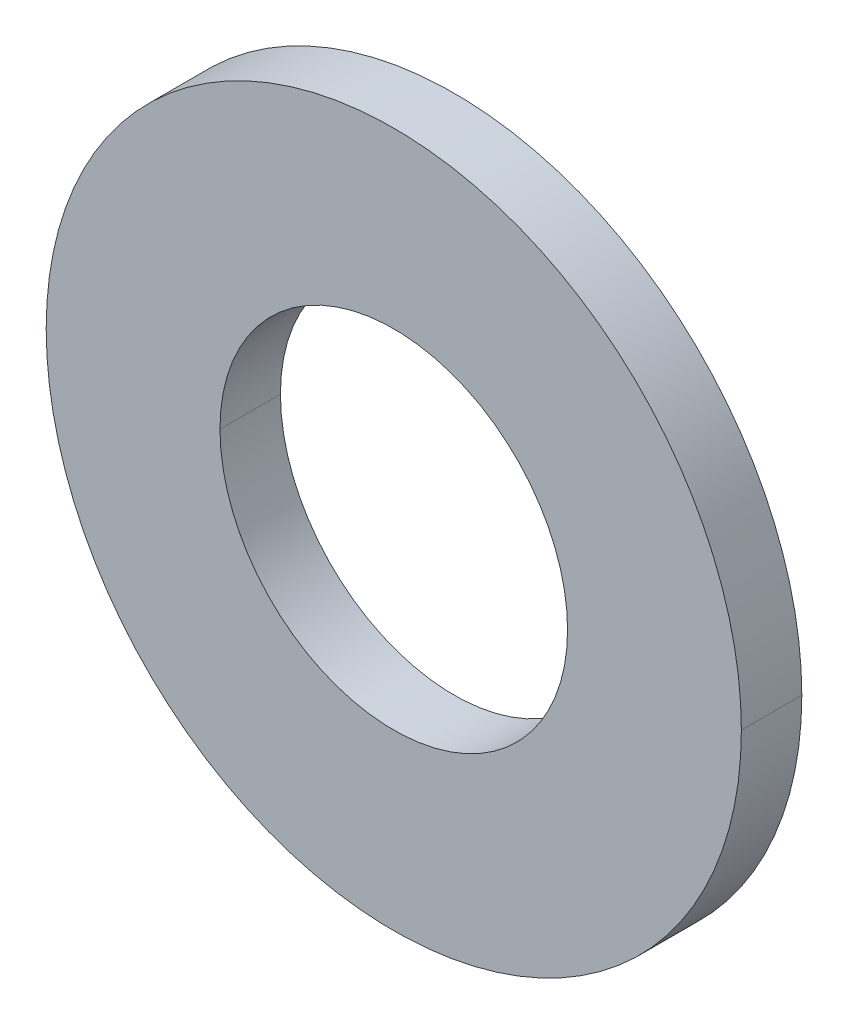
ISO-10303-21;
HEADER;
FILE_DESCRIPTION(('STEP AP214'),'2;1');
FILE_NAME('part.step','',(''),(''),'','','');
FILE_SCHEMA(('AUTOMOTIVE_DESIGN { 1 0 10303 214 1 1 1 1 }'));
ENDSEC;
DATA;
#1=APPLICATION_CONTEXT('core data for automotive mechanical design processes');
#2=APPLICATION_PROTOCOL_DEFINITION('international standard','automotive_design',2000,#1);
#3=PRODUCT_CONTEXT('',#1,'mechanical');
#4=PRODUCT('Part','Part','',(#3));
#5=PRODUCT_RELATED_PRODUCT_CATEGORY('part','',(#4));
#6=PRODUCT_DEFINITION_FORMATION('','',#4);
#7=PRODUCT_DEFINITION_CONTEXT('part definition',#1,'design');
#8=PRODUCT_DEFINITION('design','',#6,#7);
#9=PRODUCT_DEFINITION_SHAPE('','',#8);
#10=(LENGTH_UNIT() NAMED_UNIT(*) SI_UNIT(.MILLI.,.METRE.));
#11=(NAMED_UNIT(*) PLANE_ANGLE_UNIT() SI_UNIT($,.RADIAN.));
#12=(NAMED_UNIT(*) SI_UNIT($,.STERADIAN.) SOLID_ANGLE_UNIT());
#13=UNCERTAINTY_MEASURE_WITH_UNIT(LENGTH_MEASURE(1.E-05),#10,'distance_accuracy_value','');
#14=(GEOMETRIC_REPRESENTATION_CONTEXT(3) GLOBAL_UNCERTAINTY_ASSIGNED_CONTEXT((#13)) GLOBAL_UNIT_ASSIGNED_CONTEXT((#10,
#11,#12)) REPRESENTATION_CONTEXT('',''));
#15=CARTESIAN_POINT('',(0.,0.,0.));
#16=DIRECTION('',(0.,0.,1.));
#17=DIRECTION('',(1.,0.,0.));
#18=AXIS2_PLACEMENT_3D('',#15,#16,#17);
#19=CARTESIAN_POINT('',(0.,0.,1.524));
#20=DIRECTION('',(0.,0.,-1.));
#21=DIRECTION('',(-1.,0.,0.));
#22=AXIS2_PLACEMENT_3D('',#19,#20,#21);
#23=CYLINDRICAL_SURFACE('',#22,4.3815);
#24=DIRECTION('',(0.,0.,-1.));
#25=VECTOR('',#24,1.);
#26=CARTESIAN_POINT('',(4.3815,0.,1.524));
#27=LINE('',#26,#25);
#28=CARTESIAN_POINT('',(4.3815,0.,1.524));
#29=VERTEX_POINT('',#28);
#30=CARTESIAN_POINT('',(4.3815,0.,0.));
#31=VERTEX_POINT('',#30);
#32=EDGE_CURVE('E76',#29,#31,#27,.T.);
#33=ORIENTED_EDGE('',*,*,#32,.F.);
#34=CARTESIAN_POINT('',(0.,0.,1.524));
#35=DIRECTION('',(0.,0.,1.));
#36=DIRECTION('',(1.,0.,0.));
#37=AXIS2_PLACEMENT_3D('',#34,#35,#36);
#38=CIRCLE('',#37,4.3815);
#39=CARTESIAN_POINT('',(-4.3815,0.,1.524));
#40=VERTEX_POINT('',#39);
#41=EDGE_CURVE('E75',#29,#40,#38,.T.);
#42=ORIENTED_EDGE('',*,*,#41,.T.);
#43=DIRECTION('',(0.,0.,-1.));
#44=VECTOR('',#43,1.);
#45=CARTESIAN_POINT('',(-4.3815,0.,1.524));
#46=LINE('',#45,#44);
#47=CARTESIAN_POINT('',(-4.3815,0.,0.));
#48=VERTEX_POINT('',#47);
#49=EDGE_CURVE('E73',#40,#48,#46,.T.);
#50=ORIENTED_EDGE('',*,*,#49,.T.);
#51=CARTESIAN_POINT('',(0.,0.,0.));
#52=DIRECTION('',(0.,0.,1.));
#53=DIRECTION('',(1.,0.,0.));
#54=AXIS2_PLACEMENT_3D('',#51,#52,#53);
#55=CIRCLE('',#54,4.3815);
#56=EDGE_CURVE('E11',#31,#48,#55,.T.);
#57=ORIENTED_EDGE('',*,*,#56,.F.);
#58=EDGE_LOOP('',(#33,#42,#50,#57));
#59=FACE_BOUND('',#58,.T.);
#60=ADVANCED_FACE('F16',(#59),#23,.F.);
#61=CARTESIAN_POINT('',(0.,0.,1.524));
#62=DIRECTION('',(0.,0.,-1.));
#63=DIRECTION('',(-1.,0.,0.));
#64=AXIS2_PLACEMENT_3D('',#61,#62,#63);
#65=CYLINDRICAL_SURFACE('',#64,8.763);
#66=DIRECTION('',(0.,0.,-1.));
#67=VECTOR('',#66,1.);
#68=CARTESIAN_POINT('',(8.763,0.,1.524));
#69=LINE('',#68,#67);
#70=CARTESIAN_POINT('',(8.763,0.,1.524));
#71=VERTEX_POINT('',#70);
#72=CARTESIAN_POINT('',(8.763,0.,0.));
#73=VERTEX_POINT('',#72);
#74=EDGE_CURVE('E106',#71,#73,#69,.T.);
#75=ORIENTED_EDGE('',*,*,#74,.F.);
#76=CARTESIAN_POINT('',(0.,0.,1.524));
#77=DIRECTION('',(0.,0.,1.));
#78=DIRECTION('',(1.,0.,0.));
#79=AXIS2_PLACEMENT_3D('',#76,#77,#78);
#80=CIRCLE('',#79,8.763);
#81=CARTESIAN_POINT('',(-8.763,0.,1.524));
#82=VERTEX_POINT('',#81);
#83=EDGE_CURVE('E82',#82,#71,#80,.T.);
#84=ORIENTED_EDGE('',*,*,#83,.F.);
#85=DIRECTION('',(0.,0.,-1.));
#86=VECTOR('',#85,1.);
#87=CARTESIAN_POINT('',(-8.763,0.,1.524));
#88=LINE('',#87,#86);
#89=CARTESIAN_POINT('',(-8.763,0.,0.));
#90=VERTEX_POINT('',#89);
#91=EDGE_CURVE('E108',#82,#90,#88,.T.);
#92=ORIENTED_EDGE('',*,*,#91,.T.);
#93=CARTESIAN_POINT('',(0.,0.,0.));
#94=DIRECTION('',(0.,0.,1.));
#95=DIRECTION('',(1.,0.,0.));
#96=AXIS2_PLACEMENT_3D('',#93,#94,#95);
#97=CIRCLE('',#96,8.763);
#98=EDGE_CURVE('E25',#90,#73,#97,.T.);
#99=ORIENTED_EDGE('',*,*,#98,.T.);
#100=EDGE_LOOP('',(#75,#84,#92,#99));
#101=FACE_BOUND('',#100,.T.);
#102=ADVANCED_FACE('F18',(#101),#65,.T.);
#103=CARTESIAN_POINT('',(0.,0.,0.));
#104=DIRECTION('',(0.,0.,1.));
#105=DIRECTION('',(1.,0.,0.));
#106=AXIS2_PLACEMENT_3D('',#103,#104,#105);
#107=PLANE('',#106);
#108=CARTESIAN_POINT('',(0.,0.,0.));
#109=DIRECTION('',(0.,0.,1.));
#110=DIRECTION('',(1.,0.,0.));
#111=AXIS2_PLACEMENT_3D('',#108,#109,#110);
#112=CIRCLE('',#111,4.3815);
#113=EDGE_CURVE('E87',#48,#31,#112,.T.);
#114=ORIENTED_EDGE('',*,*,#113,.T.);
#115=ORIENTED_EDGE('',*,*,#56,.T.);
#116=EDGE_LOOP('',(#114,#115));
#117=FACE_BOUND('',#116,.T.);
#118=ORIENTED_EDGE('',*,*,#98,.F.);
#119=CARTESIAN_POINT('',(0.,0.,0.));
#120=DIRECTION('',(0.,0.,1.));
#121=DIRECTION('',(1.,0.,0.));
#122=AXIS2_PLACEMENT_3D('',#119,#120,#121);
#123=CIRCLE('',#122,8.763);
#124=EDGE_CURVE('E114',#73,#90,#123,.T.);
#125=ORIENTED_EDGE('',*,*,#124,.F.);
#126=EDGE_LOOP('',(#118,#125));
#127=FACE_BOUND('',#126,.T.);
#128=ADVANCED_FACE('F208',(#117,#127),#107,.F.);
#129=CARTESIAN_POINT('',(0.,0.,1.524));
#130=DIRECTION('',(0.,0.,1.));
#131=DIRECTION('',(1.,0.,0.));
#132=AXIS2_PLACEMENT_3D('',#129,#130,#131);
#133=PLANE('',#132);
#134=CARTESIAN_POINT('',(0.,0.,1.524));
#135=DIRECTION('',(0.,0.,1.));
#136=DIRECTION('',(1.,0.,0.));
#137=AXIS2_PLACEMENT_3D('',#134,#135,#136);
#138=CIRCLE('',#137,4.3815);
#139=EDGE_CURVE('E83',#40,#29,#138,.T.);
#140=ORIENTED_EDGE('',*,*,#139,.F.);
#141=ORIENTED_EDGE('',*,*,#41,.F.);
#142=EDGE_LOOP('',(#140,#141));
#143=FACE_BOUND('',#142,.T.);
#144=ORIENTED_EDGE('',*,*,#83,.T.);
#145=CARTESIAN_POINT('',(0.,0.,1.524));
#146=DIRECTION('',(0.,0.,1.));
#147=DIRECTION('',(1.,0.,0.));
#148=AXIS2_PLACEMENT_3D('',#145,#146,#147);
#149=CIRCLE('',#148,8.763);
#150=EDGE_CURVE('E90',#71,#82,#149,.T.);
#151=ORIENTED_EDGE('',*,*,#150,.T.);
#152=EDGE_LOOP('',(#144,#151));
#153=FACE_BOUND('',#152,.T.);
#154=ADVANCED_FACE('F93',(#143,#153),#133,.T.);
#155=CARTESIAN_POINT('',(0.,0.,1.524));
#156=DIRECTION('',(0.,0.,-1.));
#157=DIRECTION('',(-1.,0.,0.));
#158=AXIS2_PLACEMENT_3D('',#155,#156,#157);
#159=CYLINDRICAL_SURFACE('',#158,8.763);
#160=ORIENTED_EDGE('',*,*,#150,.F.);
#161=ORIENTED_EDGE('',*,*,#74,.T.);
#162=ORIENTED_EDGE('',*,*,#124,.T.);
#163=ORIENTED_EDGE('',*,*,#91,.F.);
#164=EDGE_LOOP('',(#160,#161,#162,#163));
#165=FACE_BOUND('',#164,.T.);
#166=ADVANCED_FACE('F188',(#165),#159,.T.);
#167=CARTESIAN_POINT('',(0.,0.,1.524));
#168=DIRECTION('',(0.,0.,-1.));
#169=DIRECTION('',(-1.,0.,0.));
#170=AXIS2_PLACEMENT_3D('',#167,#168,#169);
#171=CYLINDRICAL_SURFACE('',#170,4.3815);
#172=ORIENTED_EDGE('',*,*,#139,.T.);
#173=ORIENTED_EDGE('',*,*,#32,.T.);
#174=ORIENTED_EDGE('',*,*,#113,.F.);
#175=ORIENTED_EDGE('',*,*,#49,.F.);
#176=EDGE_LOOP('',(#172,#173,#174,#175));
#177=FACE_BOUND('',#176,.T.);
#178=ADVANCED_FACE('F81',(#177),#171,.F.);
#179=CLOSED_SHELL('',(#60,#102,#128,#154,#166,#178));
#180=MANIFOLD_SOLID_BREP('B1',#179);
#181=ADVANCED_BREP_SHAPE_REPRESENTATION('',(#18,#180),#14);
#182=SHAPE_DEFINITION_REPRESENTATION(#9,#181);
ENDSEC;
END-ISO-10303-21;
